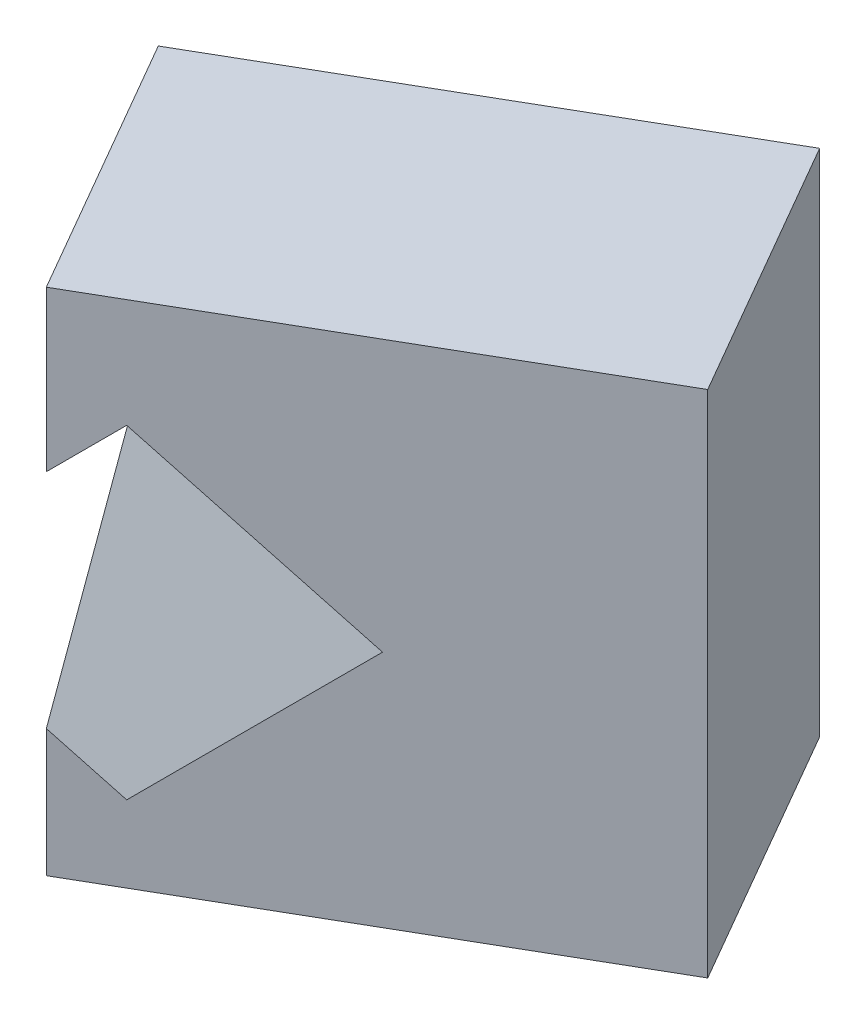
ISO-10303-21;
HEADER;
FILE_DESCRIPTION(('STEP AP214'),'2;1');
FILE_NAME('part.step','',(''),(''),'','','');
FILE_SCHEMA(('AUTOMOTIVE_DESIGN { 1 0 10303 214 1 1 1 1 }'));
ENDSEC;
DATA;
#1=APPLICATION_CONTEXT('core data for automotive mechanical design processes');
#2=APPLICATION_PROTOCOL_DEFINITION('international standard','automotive_design',2000,#1);
#3=PRODUCT_CONTEXT('',#1,'mechanical');
#4=PRODUCT('Part','Part','',(#3));
#5=PRODUCT_RELATED_PRODUCT_CATEGORY('part','',(#4));
#6=PRODUCT_DEFINITION_FORMATION('','',#4);
#7=PRODUCT_DEFINITION_CONTEXT('part definition',#1,'design');
#8=PRODUCT_DEFINITION('design','',#6,#7);
#9=PRODUCT_DEFINITION_SHAPE('','',#8);
#10=(LENGTH_UNIT() NAMED_UNIT(*) SI_UNIT(.MILLI.,.METRE.));
#11=(NAMED_UNIT(*) PLANE_ANGLE_UNIT() SI_UNIT($,.RADIAN.));
#12=(NAMED_UNIT(*) SI_UNIT($,.STERADIAN.) SOLID_ANGLE_UNIT());
#13=UNCERTAINTY_MEASURE_WITH_UNIT(LENGTH_MEASURE(1.E-05),#10,'distance_accuracy_value','');
#14=(GEOMETRIC_REPRESENTATION_CONTEXT(3) GLOBAL_UNCERTAINTY_ASSIGNED_CONTEXT((#13)) GLOBAL_UNIT_ASSIGNED_CONTEXT((#10,
#11,#12)) REPRESENTATION_CONTEXT('',''));
#15=CARTESIAN_POINT('',(0.,0.,0.));
#16=DIRECTION('',(0.,0.,1.));
#17=DIRECTION('',(1.,0.,0.));
#18=AXIS2_PLACEMENT_3D('',#15,#16,#17);
#19=CARTESIAN_POINT('',(-82.2724133595219,100.,47.4999999999995));
#20=DIRECTION('',(0.499999999999995,0.,0.866025403784441));
#21=DIRECTION('',(0.866025403784442,0.,-0.499999999999995));
#22=AXIS2_PLACEMENT_3D('',#19,#20,#21);
#23=PLANE('',#22);
#24=DIRECTION('',(-0.866025403784441,0.,0.499999999999995));
#25=VECTOR('',#24,1.);
#26=CARTESIAN_POINT('',(-82.2724133595219,0.,47.4999999999995));
#27=LINE('',#26,#25);
#28=CARTESIAN_POINT('',(0.,0.,0.));
#29=VERTEX_POINT('',#28);
#30=CARTESIAN_POINT('',(-82.2724133595219,0.,47.4999999999995));
#31=VERTEX_POINT('',#30);
#32=EDGE_CURVE('E164',#29,#31,#27,.T.);
#33=ORIENTED_EDGE('',*,*,#32,.T.);
#34=DIRECTION('',(0.,-1.,0.));
#35=VECTOR('',#34,1.);
#36=CARTESIAN_POINT('',(-82.2724133595219,100.,47.4999999999995));
#37=LINE('',#36,#35);
#38=CARTESIAN_POINT('',(-82.2724133595219,100.,47.4999999999995));
#39=VERTEX_POINT('',#38);
#40=EDGE_CURVE('E119',#39,#31,#37,.T.);
#41=ORIENTED_EDGE('',*,*,#40,.F.);
#42=DIRECTION('',(-0.866025403784441,0.,0.499999999999995));
#43=VECTOR('',#42,1.);
#44=CARTESIAN_POINT('',(-82.2724133595219,100.,47.4999999999995));
#45=LINE('',#44,#43);
#46=CARTESIAN_POINT('',(0.,100.,0.));
#47=VERTEX_POINT('',#46);
#48=EDGE_CURVE('E177',#47,#39,#45,.T.);
#49=ORIENTED_EDGE('',*,*,#48,.F.);
#50=DIRECTION('',(0.,-1.,0.));
#51=VECTOR('',#50,1.);
#52=CARTESIAN_POINT('',(0.,100.,0.));
#53=LINE('',#52,#51);
#54=EDGE_CURVE('E184',#47,#29,#53,.T.);
#55=ORIENTED_EDGE('',*,*,#54,.T.);
#56=EDGE_LOOP('',(#33,#41,#49,#55));
#57=FACE_BOUND('',#56,.T.);
#58=DIRECTION('',(0.654653670707981,0.654653670707974,-0.377964473009225));
#59=VECTOR('',#58,1.);
#60=CARTESIAN_POINT('',(-55.9751034910031,64.9369201753081,32.3172410684474));
#61=LINE('',#60,#59);
#62=CARTESIAN_POINT('',(-74.0922185129167,46.8198051533948,42.7771623032885));
#63=VERTEX_POINT('',#62);
#64=CARTESIAN_POINT('',(-42.2724133595218,78.6396103067893,24.4059892324148));
#65=VERTEX_POINT('',#64);
#66=EDGE_CURVE('E113',#63,#65,#61,.T.);
#67=ORIENTED_EDGE('',*,*,#66,.F.);
#68=DIRECTION('',(-0.654653670707976,0.654653670707982,0.377964473009221));
#69=VECTOR('',#68,1.);
#70=CARTESIAN_POINT('',(-101.558127645236,74.2857142857147,58.6346123343708));
#71=LINE('',#70,#69);
#72=CARTESIAN_POINT('',(-42.2724133595222,15.,24.405989232415));
#73=VERTEX_POINT('',#72);
#74=EDGE_CURVE('E114',#73,#63,#71,.T.);
#75=ORIENTED_EDGE('',*,*,#74,.F.);
#76=DIRECTION('',(-0.654653670707981,-0.654653670707975,0.377964473009225));
#77=VECTOR('',#76,1.);
#78=CARTESIAN_POINT('',(-28.7009847880935,28.5714285714285,16.5705212934129));
#79=LINE('',#78,#77);
#80=CARTESIAN_POINT('',(-10.4526082061274,46.8198051533945,6.03481616154126));
#81=VERTEX_POINT('',#80);
#82=EDGE_CURVE('E142',#81,#73,#79,.T.);
#83=ORIENTED_EDGE('',*,*,#82,.F.);
#84=DIRECTION('',(0.654653670707975,-0.654653670707983,-0.377964473009221));
#85=VECTOR('',#84,1.);
#86=CARTESIAN_POINT('',(-74.2840089423263,110.651205889594,42.8878925593361));
#87=LINE('',#86,#85);
#88=EDGE_CURVE('E147',#65,#81,#87,.T.);
#89=ORIENTED_EDGE('',*,*,#88,.F.);
#90=EDGE_LOOP('',(#67,#75,#83,#89));
#91=FACE_BOUND('',#90,.T.);
#92=ADVANCED_FACE('F30',(#57,#91),#23,.F.);
#93=CARTESIAN_POINT('',(-52.2724133595222,100.,99.461524227066));
#94=DIRECTION('',(0.866025403784441,0.,-0.499999999999995));
#95=DIRECTION('',(-0.499999999999995,0.,-0.866025403784441));
#96=AXIS2_PLACEMENT_3D('',#93,#94,#95);
#97=PLANE('',#96);
#98=DIRECTION('',(-0.447213595499956,-0.447213595499951,-0.774596669241489));
#99=VECTOR('',#98,1.);
#100=CARTESIAN_POINT('',(-46.0003354208801,74.911688245431,110.325081885826));
#101=LINE('',#100,#99);
#102=CARTESIAN_POINT('',(-52.2724133595222,68.6396103067891,99.461524227066));
#103=VERTEX_POINT('',#102);
#104=CARTESIAN_POINT('',(-74.0922185129167,46.8198051533948,61.6685130901331));
#105=VERTEX_POINT('',#104);
#106=EDGE_CURVE('E100',#103,#105,#101,.T.);
#107=ORIENTED_EDGE('',*,*,#106,.F.);
#108=DIRECTION('',(0.,-1.,0.));
#109=VECTOR('',#108,1.);
#110=CARTESIAN_POINT('',(-52.2724133595222,100.,99.461524227066));
#111=LINE('',#110,#109);
#112=CARTESIAN_POINT('',(-52.2724133595222,100.,99.461524227066));
#113=VERTEX_POINT('',#112);
#114=EDGE_CURVE('E109',#113,#103,#111,.T.);
#115=ORIENTED_EDGE('',*,*,#114,.F.);
#116=DIRECTION('',(0.499999999999995,0.,0.866025403784441));
#117=VECTOR('',#116,1.);
#118=CARTESIAN_POINT('',(-52.2724133595222,100.,99.461524227066));
#119=LINE('',#118,#117);
#120=EDGE_CURVE('E180',#39,#113,#119,.T.);
#121=ORIENTED_EDGE('',*,*,#120,.F.);
#122=ORIENTED_EDGE('',*,*,#40,.T.);
#123=DIRECTION('',(0.499999999999995,0.,0.866025403784441));
#124=VECTOR('',#123,1.);
#125=CARTESIAN_POINT('',(-52.2724133595222,0.,99.461524227066));
#126=LINE('',#125,#124);
#127=CARTESIAN_POINT('',(-52.2724133595222,0.,99.461524227066));
#128=VERTEX_POINT('',#127);
#129=EDGE_CURVE('E167',#31,#128,#126,.T.);
#130=ORIENTED_EDGE('',*,*,#129,.T.);
#131=CARTESIAN_POINT('',(-52.2724133595222,25.0000000000001,99.461524227066));
#132=VERTEX_POINT('',#131);
#133=EDGE_CURVE('E120',#132,#128,#111,.T.);
#134=ORIENTED_EDGE('',*,*,#133,.F.);
#135=DIRECTION('',(0.447213595499954,-0.447213595499958,0.774596669241486));
#136=VECTOR('',#135,1.);
#137=CARTESIAN_POINT('',(-67.272413359522,40.0000000000001,73.4807621135328));
#138=LINE('',#137,#136);
#139=EDGE_CURVE('E112',#105,#132,#138,.T.);
#140=ORIENTED_EDGE('',*,*,#139,.F.);
#141=EDGE_LOOP('',(#107,#115,#121,#122,#130,#134,#140));
#142=FACE_BOUND('',#141,.T.);
#143=ADVANCED_FACE('F108',(#142),#97,.F.);
#144=CARTESIAN_POINT('',(29.9999999999997,100.,51.9615242270665));
#145=DIRECTION('',(-0.499999999999995,0.,-0.866025403784441));
#146=DIRECTION('',(-0.866025403784441,0.,0.499999999999995));
#147=AXIS2_PLACEMENT_3D('',#144,#145,#146);
#148=PLANE('',#147);
#149=DIRECTION('',(-0.654653670707981,-0.654653670707974,0.377964473009225));
#150=VECTOR('',#149,1.);
#151=CARTESIAN_POINT('',(8.18056128586679,129.092584952177,64.5589830422375));
#152=LINE('',#151,#150);
#153=CARTESIAN_POINT('',(-42.2724133595219,78.6396103067893,93.6880215351696));
#154=VERTEX_POINT('',#153);
#155=EDGE_CURVE('E11',#154,#103,#152,.T.);
#156=ORIENTED_EDGE('',*,*,#155,.F.);
#157=DIRECTION('',(-0.654653670707975,0.654653670707983,0.377964473009221));
#158=VECTOR('',#157,1.);
#159=CARTESIAN_POINT('',(-10.1283441654575,46.4955411127246,75.1296345331269));
#160=LINE('',#159,#158);
#161=CARTESIAN_POINT('',(-10.4526082061274,46.8198051533945,75.3168484642961));
#162=VERTEX_POINT('',#161);
#163=EDGE_CURVE('E123',#162,#154,#160,.T.);
#164=ORIENTED_EDGE('',*,*,#163,.F.);
#165=DIRECTION('',(0.654653670707981,0.654653670707974,-0.377964473009225));
#166=VECTOR('',#165,1.);
#167=CARTESIAN_POINT('',(35.4546799887764,92.7270933482978,48.812263267203));
#168=LINE('',#167,#166);
#169=CARTESIAN_POINT('',(-42.2724133595222,15.,93.6880215351698));
#170=VERTEX_POINT('',#169);
#171=EDGE_CURVE('E130',#170,#162,#168,.T.);
#172=ORIENTED_EDGE('',*,*,#171,.F.);
#173=DIRECTION('',(0.654653670707975,-0.654653670707982,-0.377964473009222));
#174=VECTOR('',#173,1.);
#175=CARTESIAN_POINT('',(-37.4024628683675,10.1300495088452,90.8763543081615));
#176=LINE('',#175,#174);
#177=EDGE_CURVE('E37',#132,#170,#176,.T.);
#178=ORIENTED_EDGE('',*,*,#177,.F.);
#179=ORIENTED_EDGE('',*,*,#133,.T.);
#180=DIRECTION('',(0.866025403784441,0.,-0.499999999999995));
#181=VECTOR('',#180,1.);
#182=CARTESIAN_POINT('',(29.9999999999997,0.,51.9615242270665));
#183=LINE('',#182,#181);
#184=CARTESIAN_POINT('',(29.9999999999997,0.,51.9615242270665));
#185=VERTEX_POINT('',#184);
#186=EDGE_CURVE('E173',#128,#185,#183,.T.);
#187=ORIENTED_EDGE('',*,*,#186,.T.);
#188=DIRECTION('',(0.,-1.,0.));
#189=VECTOR('',#188,1.);
#190=CARTESIAN_POINT('',(29.9999999999997,100.,51.9615242270665));
#191=LINE('',#190,#189);
#192=CARTESIAN_POINT('',(29.9999999999997,100.,51.9615242270665));
#193=VERTEX_POINT('',#192);
#194=EDGE_CURVE('E125',#193,#185,#191,.T.);
#195=ORIENTED_EDGE('',*,*,#194,.F.);
#196=DIRECTION('',(0.866025403784441,0.,-0.499999999999995));
#197=VECTOR('',#196,1.);
#198=CARTESIAN_POINT('',(29.9999999999997,100.,51.9615242270665));
#199=LINE('',#198,#197);
#200=EDGE_CURVE('E118',#113,#193,#199,.T.);
#201=ORIENTED_EDGE('',*,*,#200,.F.);
#202=ORIENTED_EDGE('',*,*,#114,.T.);
#203=EDGE_LOOP('',(#156,#164,#172,#178,#179,#187,#195,#201,#202));
#204=FACE_BOUND('',#203,.T.);
#205=ADVANCED_FACE('F116',(#204),#148,.F.);
#206=CARTESIAN_POINT('',(0.,100.,0.));
#207=DIRECTION('',(-0.866025403784441,0.,0.499999999999996));
#208=DIRECTION('',(0.499999999999996,0.,0.866025403784441));
#209=AXIS2_PLACEMENT_3D('',#206,#207,#208);
#210=PLANE('',#209);
#211=DIRECTION('',(-0.499999999999996,0.,-0.866025403784441));
#212=VECTOR('',#211,1.);
#213=CARTESIAN_POINT('',(0.,0.,0.));
#214=LINE('',#213,#212);
#215=EDGE_CURVE('E175',#185,#29,#214,.T.);
#216=ORIENTED_EDGE('',*,*,#215,.T.);
#217=ORIENTED_EDGE('',*,*,#54,.F.);
#218=DIRECTION('',(-0.499999999999996,0.,-0.866025403784441));
#219=VECTOR('',#218,1.);
#220=CARTESIAN_POINT('',(0.,100.,0.));
#221=LINE('',#220,#219);
#222=EDGE_CURVE('E183',#193,#47,#221,.T.);
#223=ORIENTED_EDGE('',*,*,#222,.F.);
#224=ORIENTED_EDGE('',*,*,#194,.T.);
#225=EDGE_LOOP('',(#216,#217,#223,#224));
#226=FACE_BOUND('',#225,.T.);
#227=ADVANCED_FACE('F191',(#226),#210,.F.);
#228=CARTESIAN_POINT('',(-82.2724133595219,100.,47.4999999999995));
#229=DIRECTION('',(0.,1.,0.));
#230=DIRECTION('',(0.,0.,1.));
#231=AXIS2_PLACEMENT_3D('',#228,#229,#230);
#232=PLANE('',#231);
#233=ORIENTED_EDGE('',*,*,#48,.T.);
#234=ORIENTED_EDGE('',*,*,#120,.T.);
#235=ORIENTED_EDGE('',*,*,#200,.T.);
#236=ORIENTED_EDGE('',*,*,#222,.T.);
#237=EDGE_LOOP('',(#233,#234,#235,#236));
#238=FACE_BOUND('',#237,.T.);
#239=ADVANCED_FACE('F196',(#238),#232,.T.);
#240=CARTESIAN_POINT('',(-82.2724133595219,0.,47.4999999999995));
#241=DIRECTION('',(0.,1.,0.));
#242=DIRECTION('',(0.,0.,1.));
#243=AXIS2_PLACEMENT_3D('',#240,#241,#242);
#244=PLANE('',#243);
#245=ORIENTED_EDGE('',*,*,#32,.F.);
#246=ORIENTED_EDGE('',*,*,#215,.F.);
#247=ORIENTED_EDGE('',*,*,#186,.F.);
#248=ORIENTED_EDGE('',*,*,#129,.F.);
#249=EDGE_LOOP('',(#245,#246,#247,#248));
#250=FACE_BOUND('',#249,.T.);
#251=ADVANCED_FACE('F194',(#250),#244,.F.);
#252=CARTESIAN_POINT('',(-74.0922185129167,46.8198051533948,99.461524227066));
#253=DIRECTION('',(0.707106781186544,-0.707106781186551,0.));
#254=DIRECTION('',(0.707106781186551,0.707106781186544,0.));
#255=AXIS2_PLACEMENT_3D('',#252,#253,#254);
#256=PLANE('',#255);
#257=ORIENTED_EDGE('',*,*,#66,.T.);
#258=DIRECTION('',(0.,0.,-1.));
#259=VECTOR('',#258,1.);
#260=CARTESIAN_POINT('',(-42.2724133595219,78.6396103067893,99.461524227066));
#261=LINE('',#260,#259);
#262=EDGE_CURVE('E44',#154,#65,#261,.T.);
#263=ORIENTED_EDGE('',*,*,#262,.F.);
#264=ORIENTED_EDGE('',*,*,#155,.T.);
#265=ORIENTED_EDGE('',*,*,#106,.T.);
#266=DIRECTION('',(0.,0.,-1.));
#267=VECTOR('',#266,1.);
#268=CARTESIAN_POINT('',(-74.0922185129167,46.8198051533948,99.461524227066));
#269=LINE('',#268,#267);
#270=EDGE_CURVE('E143',#105,#63,#269,.T.);
#271=ORIENTED_EDGE('',*,*,#270,.T.);
#272=EDGE_LOOP('',(#257,#263,#264,#265,#271));
#273=FACE_BOUND('',#272,.T.);
#274=ADVANCED_FACE('F98',(#273),#256,.T.);
#275=CARTESIAN_POINT('',(-42.2724133595222,15.,99.461524227066));
#276=DIRECTION('',(0.707106781186551,0.707106781186544,0.));
#277=DIRECTION('',(-0.707106781186544,0.707106781186551,0.));
#278=AXIS2_PLACEMENT_3D('',#275,#276,#277);
#279=PLANE('',#278);
#280=ORIENTED_EDGE('',*,*,#74,.T.);
#281=ORIENTED_EDGE('',*,*,#270,.F.);
#282=ORIENTED_EDGE('',*,*,#139,.T.);
#283=ORIENTED_EDGE('',*,*,#177,.T.);
#284=DIRECTION('',(0.,0.,-1.));
#285=VECTOR('',#284,1.);
#286=CARTESIAN_POINT('',(-42.2724133595222,15.,99.461524227066));
#287=LINE('',#286,#285);
#288=EDGE_CURVE('E136',#170,#73,#287,.T.);
#289=ORIENTED_EDGE('',*,*,#288,.T.);
#290=EDGE_LOOP('',(#280,#281,#282,#283,#289));
#291=FACE_BOUND('',#290,.T.);
#292=ADVANCED_FACE('F135',(#291),#279,.T.);
#293=CARTESIAN_POINT('',(-10.4526082061274,46.8198051533945,99.461524227066));
#294=DIRECTION('',(-0.707106781186544,0.707106781186551,0.));
#295=DIRECTION('',(-0.707106781186551,-0.707106781186544,0.));
#296=AXIS2_PLACEMENT_3D('',#293,#294,#295);
#297=PLANE('',#296);
#298=ORIENTED_EDGE('',*,*,#82,.T.);
#299=ORIENTED_EDGE('',*,*,#288,.F.);
#300=ORIENTED_EDGE('',*,*,#171,.T.);
#301=DIRECTION('',(0.,0.,-1.));
#302=VECTOR('',#301,1.);
#303=CARTESIAN_POINT('',(-10.4526082061274,46.8198051533945,99.461524227066));
#304=LINE('',#303,#302);
#305=EDGE_CURVE('E49',#162,#81,#304,.T.);
#306=ORIENTED_EDGE('',*,*,#305,.T.);
#307=EDGE_LOOP('',(#298,#299,#300,#306));
#308=FACE_BOUND('',#307,.T.);
#309=ADVANCED_FACE('F140',(#308),#297,.T.);
#310=CARTESIAN_POINT('',(-42.2724133595219,78.6396103067893,99.461524227066));
#311=DIRECTION('',(-0.707106781186551,-0.707106781186543,0.));
#312=DIRECTION('',(0.707106781186544,-0.707106781186552,0.));
#313=AXIS2_PLACEMENT_3D('',#310,#311,#312);
#314=PLANE('',#313);
#315=ORIENTED_EDGE('',*,*,#88,.T.);
#316=ORIENTED_EDGE('',*,*,#305,.F.);
#317=ORIENTED_EDGE('',*,*,#163,.T.);
#318=ORIENTED_EDGE('',*,*,#262,.T.);
#319=EDGE_LOOP('',(#315,#316,#317,#318));
#320=FACE_BOUND('',#319,.T.);
#321=ADVANCED_FACE('F145',(#320),#314,.T.);
#322=CLOSED_SHELL('',(#92,#143,#205,#227,#239,#251,#274,#292,#309,#321));
#323=MANIFOLD_SOLID_BREP('B2',#322);
#324=ADVANCED_BREP_SHAPE_REPRESENTATION('',(#18,#323),#14);
#325=SHAPE_DEFINITION_REPRESENTATION(#9,#324);
ENDSEC;
END-ISO-10303-21;
